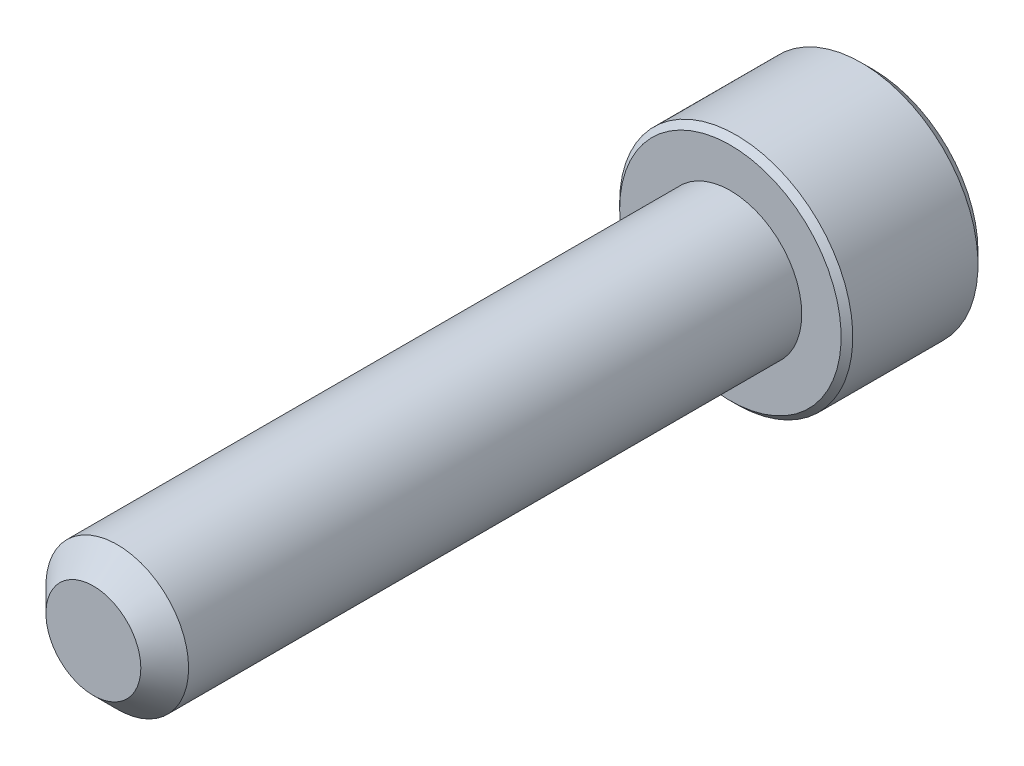
ISO-10303-21;
HEADER;
FILE_DESCRIPTION(('STEP AP214'),'2;1');
FILE_NAME('part.step','',(''),(''),'','','');
FILE_SCHEMA(('AUTOMOTIVE_DESIGN { 1 0 10303 214 1 1 1 1 }'));
ENDSEC;
DATA;
#1=APPLICATION_CONTEXT('core data for automotive mechanical design processes');
#2=APPLICATION_PROTOCOL_DEFINITION('international standard','automotive_design',2000,#1);
#3=PRODUCT_CONTEXT('',#1,'mechanical');
#4=PRODUCT('Part','Part','',(#3));
#5=PRODUCT_RELATED_PRODUCT_CATEGORY('part','',(#4));
#6=PRODUCT_DEFINITION_FORMATION('','',#4);
#7=PRODUCT_DEFINITION_CONTEXT('part definition',#1,'design');
#8=PRODUCT_DEFINITION('design','',#6,#7);
#9=PRODUCT_DEFINITION_SHAPE('','',#8);
#10=(LENGTH_UNIT() NAMED_UNIT(*) SI_UNIT(.MILLI.,.METRE.));
#11=(NAMED_UNIT(*) PLANE_ANGLE_UNIT() SI_UNIT($,.RADIAN.));
#12=(NAMED_UNIT(*) SI_UNIT($,.STERADIAN.) SOLID_ANGLE_UNIT());
#13=UNCERTAINTY_MEASURE_WITH_UNIT(LENGTH_MEASURE(1.E-05),#10,'distance_accuracy_value','');
#14=(GEOMETRIC_REPRESENTATION_CONTEXT(3) GLOBAL_UNCERTAINTY_ASSIGNED_CONTEXT((#13)) GLOBAL_UNIT_ASSIGNED_CONTEXT((#10,
#11,#12)) REPRESENTATION_CONTEXT('',''));
#15=CARTESIAN_POINT('',(0.,0.,0.));
#16=DIRECTION('',(0.,0.,1.));
#17=DIRECTION('',(1.,0.,0.));
#18=AXIS2_PLACEMENT_3D('',#15,#16,#17);
#19=CARTESIAN_POINT('',(0.,0.,-12.7));
#20=DIRECTION('',(0.,0.,1.));
#21=DIRECTION('',(1.,0.,0.));
#22=AXIS2_PLACEMENT_3D('',#19,#20,#21);
#23=CYLINDRICAL_SURFACE('',#22,1.4224);
#24=CARTESIAN_POINT('',(0.,0.,-0.476249999999999));
#25=DIRECTION('',(0.,0.,1.));
#26=DIRECTION('',(1.,0.,0.));
#27=AXIS2_PLACEMENT_3D('',#24,#25,#26);
#28=CIRCLE('',#27,1.4224);
#29=CARTESIAN_POINT('',(1.4224,0.,-0.476249999999999));
#30=VERTEX_POINT('',#29);
#31=EDGE_CURVE('E109',#30,#30,#28,.F.);
#32=ORIENTED_EDGE('',*,*,#31,.T.);
#33=EDGE_LOOP('',(#32));
#34=FACE_BOUND('',#33,.T.);
#35=CARTESIAN_POINT('',(0.,0.,-12.7));
#36=DIRECTION('',(0.,0.,-1.));
#37=DIRECTION('',(-1.,0.,0.));
#38=AXIS2_PLACEMENT_3D('',#35,#36,#37);
#39=CIRCLE('',#38,1.4224);
#40=CARTESIAN_POINT('',(-1.4224,0.,-12.7));
#41=VERTEX_POINT('',#40);
#42=EDGE_CURVE('E209',#41,#41,#39,.F.);
#43=ORIENTED_EDGE('',*,*,#42,.T.);
#44=EDGE_LOOP('',(#43));
#45=FACE_BOUND('',#44,.T.);
#46=ADVANCED_FACE('F35',(#34,#45),#23,.T.);
#47=CARTESIAN_POINT('',(0.,0.,0.));
#48=DIRECTION('',(0.,0.,1.));
#49=DIRECTION('',(1.,0.,0.));
#50=AXIS2_PLACEMENT_3D('',#47,#48,#49);
#51=PLANE('',#50);
#52=CARTESIAN_POINT('',(0.,0.,0.));
#53=DIRECTION('',(0.,0.,1.));
#54=DIRECTION('',(1.,0.,0.));
#55=AXIS2_PLACEMENT_3D('',#52,#53,#54);
#56=CIRCLE('',#55,0.946150000000003);
#57=CARTESIAN_POINT('',(0.946150000000003,0.,0.));
#58=VERTEX_POINT('',#57);
#59=EDGE_CURVE('E208',#58,#58,#56,.T.);
#60=ORIENTED_EDGE('',*,*,#59,.T.);
#61=EDGE_LOOP('',(#60));
#62=FACE_BOUND('',#61,.T.);
#63=ADVANCED_FACE('F186',(#62),#51,.T.);
#64=CARTESIAN_POINT('',(0.,0.,0.));
#65=DIRECTION('',(0.,0.,-1.));
#66=DIRECTION('',(-1.,0.,0.));
#67=AXIS2_PLACEMENT_3D('',#64,#65,#66);
#68=CONICAL_SURFACE('',#67,0.946150000000003,0.785398163397446);
#69=ORIENTED_EDGE('',*,*,#31,.F.);
#70=EDGE_LOOP('',(#69));
#71=FACE_BOUND('',#70,.T.);
#72=ORIENTED_EDGE('',*,*,#59,.F.);
#73=EDGE_LOOP('',(#72));
#74=FACE_BOUND('',#73,.T.);
#75=ADVANCED_FACE('F192',(#71,#74),#68,.T.);
#76=CARTESIAN_POINT('',(0.,0.,-15.5448));
#77=DIRECTION('',(0.,0.,1.));
#78=DIRECTION('',(1.,0.,0.));
#79=AXIS2_PLACEMENT_3D('',#76,#77,#78);
#80=CYLINDRICAL_SURFACE('',#79,2.3241);
#81=CARTESIAN_POINT('',(0.,0.,-12.816205));
#82=DIRECTION('',(0.,0.,-1.));
#83=DIRECTION('',(-1.,0.,0.));
#84=AXIS2_PLACEMENT_3D('',#81,#82,#83);
#85=CIRCLE('',#84,2.3241);
#86=CARTESIAN_POINT('',(-2.3241,0.,-12.816205));
#87=VERTEX_POINT('',#86);
#88=EDGE_CURVE('E43',#87,#87,#85,.T.);
#89=ORIENTED_EDGE('',*,*,#88,.T.);
#90=EDGE_LOOP('',(#89));
#91=FACE_BOUND('',#90,.T.);
#92=CARTESIAN_POINT('',(0.,0.,-15.31239));
#93=DIRECTION('',(0.,0.,-1.));
#94=DIRECTION('',(-1.,0.,0.));
#95=AXIS2_PLACEMENT_3D('',#92,#93,#94);
#96=CIRCLE('',#95,2.3241);
#97=CARTESIAN_POINT('',(-2.3241,0.,-15.31239));
#98=VERTEX_POINT('',#97);
#99=EDGE_CURVE('E169',#98,#98,#96,.F.);
#100=ORIENTED_EDGE('',*,*,#99,.T.);
#101=EDGE_LOOP('',(#100));
#102=FACE_BOUND('',#101,.T.);
#103=ADVANCED_FACE('F174',(#91,#102),#80,.T.);
#104=CARTESIAN_POINT('',(0.,0.,-15.5448));
#105=DIRECTION('',(0.,0.,-1.));
#106=DIRECTION('',(-1.,0.,0.));
#107=AXIS2_PLACEMENT_3D('',#104,#105,#106);
#108=PLANE('',#107);
#109=CARTESIAN_POINT('',(0.,0.,-15.5448));
#110=DIRECTION('',(0.,0.,-1.));
#111=DIRECTION('',(-1.,0.,0.));
#112=AXIS2_PLACEMENT_3D('',#109,#110,#111);
#113=CIRCLE('',#112,2.09169);
#114=CARTESIAN_POINT('',(-2.09169,0.,-15.5448));
#115=VERTEX_POINT('',#114);
#116=EDGE_CURVE('E108',#115,#115,#113,.T.);
#117=ORIENTED_EDGE('',*,*,#116,.T.);
#118=EDGE_LOOP('',(#117));
#119=FACE_BOUND('',#118,.T.);
#120=CARTESIAN_POINT('',(0.,0.,-15.5448));
#121=DIRECTION('',(0.,0.,-1.));
#122=DIRECTION('',(-1.,0.,0.));
#123=AXIS2_PLACEMENT_3D('',#120,#121,#122);
#124=CIRCLE('',#123,1.3748153285078);
#125=CARTESIAN_POINT('',(-1.190625,0.687407664253897,-15.5448));
#126=VERTEX_POINT('',#125);
#127=CARTESIAN_POINT('',(0.,1.3748153285078,-15.5448));
#128=VERTEX_POINT('',#127);
#129=EDGE_CURVE('E89',#126,#128,#124,.T.);
#130=ORIENTED_EDGE('',*,*,#129,.F.);
#131=CARTESIAN_POINT('',(-1.190625,-0.687407664253898,-15.5448));
#132=VERTEX_POINT('',#131);
#133=EDGE_CURVE('E49',#132,#126,#124,.T.);
#134=ORIENTED_EDGE('',*,*,#133,.F.);
#135=CARTESIAN_POINT('',(0.,-1.3748153285078,-15.5448));
#136=VERTEX_POINT('',#135);
#137=EDGE_CURVE('E265',#136,#132,#124,.T.);
#138=ORIENTED_EDGE('',*,*,#137,.F.);
#139=CARTESIAN_POINT('',(1.190625,-0.687407664253898,-15.5448));
#140=VERTEX_POINT('',#139);
#141=EDGE_CURVE('E56',#140,#136,#124,.T.);
#142=ORIENTED_EDGE('',*,*,#141,.F.);
#143=CARTESIAN_POINT('',(1.190625,0.687407664253899,-15.5448));
#144=VERTEX_POINT('',#143);
#145=EDGE_CURVE('E130',#144,#140,#124,.T.);
#146=ORIENTED_EDGE('',*,*,#145,.F.);
#147=EDGE_CURVE('E98',#128,#144,#124,.T.);
#148=ORIENTED_EDGE('',*,*,#147,.F.);
#149=EDGE_LOOP('',(#130,#134,#138,#142,#146,#148));
#150=FACE_BOUND('',#149,.T.);
#151=ADVANCED_FACE('F129',(#119,#150),#108,.T.);
#152=CARTESIAN_POINT('',(0.,0.,-12.7));
#153=DIRECTION('',(0.,0.,-1.));
#154=DIRECTION('',(-1.,0.,0.));
#155=AXIS2_PLACEMENT_3D('',#152,#153,#154);
#156=PLANE('',#155);
#157=CARTESIAN_POINT('',(0.,0.,-12.7));
#158=DIRECTION('',(0.,0.,-1.));
#159=DIRECTION('',(-1.,0.,0.));
#160=AXIS2_PLACEMENT_3D('',#157,#158,#159);
#161=CIRCLE('',#160,2.207895);
#162=CARTESIAN_POINT('',(-2.207895,0.,-12.7));
#163=VERTEX_POINT('',#162);
#164=EDGE_CURVE('E11',#163,#163,#161,.F.);
#165=ORIENTED_EDGE('',*,*,#164,.T.);
#166=EDGE_LOOP('',(#165));
#167=FACE_BOUND('',#166,.T.);
#168=ORIENTED_EDGE('',*,*,#42,.F.);
#169=EDGE_LOOP('',(#168));
#170=FACE_BOUND('',#169,.T.);
#171=ADVANCED_FACE('F277',(#167,#170),#156,.F.);
#172=CARTESIAN_POINT('',(0.,0.,-15.5448));
#173=DIRECTION('',(0.,0.,-1.));
#174=DIRECTION('',(-1.,0.,0.));
#175=AXIS2_PLACEMENT_3D('',#172,#173,#174);
#176=CONICAL_SURFACE('',#175,1.3748153285078,0.78539816339745);
#177=ORIENTED_EDGE('',*,*,#147,.T.);
#178=CARTESIAN_POINT('',(-0.00020000000000008,1.37493079856163,-15.5449154846));
#179=CARTESIAN_POINT('',(0.0407344195898564,1.35129730039231,-15.5212987642143));
#180=CARTESIAN_POINT('',(0.0823533883019738,1.32726857760297,-15.4990687817231));
#181=CARTESIAN_POINT('',(0.167219443673632,1.27827113768909,-15.4583656626274));
#182=CARTESIAN_POINT('',(0.21047460729096,1.25329775733078,-15.4399151826475));
#183=CARTESIAN_POINT('',(0.297696647457423,1.2029400889614,-15.4083088380043));
#184=CARTESIAN_POINT('',(0.341641294957924,1.17756863489755,-15.3950735042433));
#185=CARTESIAN_POINT('',(0.430498374163692,1.12626697629869,-15.3746814515754));
#186=CARTESIAN_POINT('',(0.475408088834753,1.10033834044413,-15.367509502896));
#187=CARTESIAN_POINT('',(0.552804127656977,1.05565371659591,-15.3610385386489));
#188=CARTESIAN_POINT('',(0.585190412515645,1.0369554863147,-15.3600803201468));
#189=CARTESIAN_POINT('',(0.649906073317768,0.999591882129811,-15.3616926490721));
#190=CARTESIAN_POINT('',(0.682235435127271,0.980926516386365,-15.3642639751796));
#191=CARTESIAN_POINT('',(0.746582156071483,0.943775919727755,-15.3727867539936));
#192=CARTESIAN_POINT('',(0.778599196336766,0.925290872911938,-15.3787413547526));
#193=CARTESIAN_POINT('',(0.842098763396455,0.888629380776602,-15.3937099640712));
#194=CARTESIAN_POINT('',(0.873581054644162,0.870453071450032,-15.4027252859121));
#195=CARTESIAN_POINT('',(0.954214838572125,0.823899134593445,-15.429482295838));
#196=CARTESIAN_POINT('',(1.00285783526766,0.795815087357089,-15.449236814436));
#197=CARTESIAN_POINT('',(1.09823941635212,0.740746505842243,-15.4937367689577));
#198=CARTESIAN_POINT('',(1.14498361758716,0.713758728676141,-15.5184659647162));
#199=CARTESIAN_POINT('',(1.190825,0.68729219420006,-15.5449154846));
#200=B_SPLINE_CURVE_WITH_KNOTS('',3,(#178,#179,#180,#181,#182,#183,#184,#185,#186,#187,#188,
#189,#190,#191,#192,#193,#194,#195,#196,#197,#198,#199),.UNSPECIFIED.,.F.,.F.,(4,2,2,2,2,2,2,2,
2,2,4),(0.,0.158625672934121,0.31817607984327,0.475191357500654,0.631811068630747,
0.743878551794716,0.855970763007027,0.96816744442324,1.08041232768376,1.25873351645467,
1.43648174479847),.UNSPECIFIED.);
#201=EDGE_CURVE('E103',#128,#144,#200,.T.);
#202=ORIENTED_EDGE('',*,*,#201,.F.);
#203=EDGE_LOOP('',(#177,#202));
#204=FACE_BOUND('',#203,.T.);
#205=ADVANCED_FACE('F104',(#204),#176,.F.);
#206=ORIENTED_EDGE('',*,*,#145,.T.);
#207=CARTESIAN_POINT('',(1.190625,-1.37097145294694,-15.9857904472899));
#208=CARTESIAN_POINT('',(1.190625,-1.3375892063789,-15.9605899888078));
#209=CARTESIAN_POINT('',(1.190625,-1.30402095496658,-15.9356366202375));
#210=CARTESIAN_POINT('',(1.190625,-1.23643692297761,-15.8863260871772));
#211=CARTESIAN_POINT('',(1.190625,-1.20242103219112,-15.8619690738994));
#212=CARTESIAN_POINT('',(1.190625,-1.09909081482554,-15.7895982089892));
#213=CARTESIAN_POINT('',(1.190625,-1.02900143506767,-15.7426726225956));
#214=CARTESIAN_POINT('',(1.190625,-0.882026737424228,-15.6505521033256));
#215=CARTESIAN_POINT('',(1.190625,-0.80498186601998,-15.6056088372421));
#216=CARTESIAN_POINT('',(1.190625,-0.647043893307964,-15.5233980245069));
#217=CARTESIAN_POINT('',(1.190625,-0.56616494370292,-15.4861046017321));
#218=CARTESIAN_POINT('',(1.190625,-0.444764933868856,-15.4404795555631));
#219=CARTESIAN_POINT('',(1.190625,-0.406041211486714,-15.4273848390215));
#220=CARTESIAN_POINT('',(1.190625,-0.327658904711933,-15.4043042758966));
#221=CARTESIAN_POINT('',(1.190625,-0.288000256118252,-15.394318643486));
#222=CARTESIAN_POINT('',(1.190625,-0.208647693212097,-15.3781412290653));
#223=CARTESIAN_POINT('',(1.190625,-0.168967240621962,-15.371884445849));
#224=CARTESIAN_POINT('',(1.190625,-0.089181974296534,-15.3632868884185));
#225=CARTESIAN_POINT('',(1.190625,-0.0490772347013132,-15.3609454410499));
#226=CARTESIAN_POINT('',(1.190625,0.0297075773931756,-15.3603522440677));
#227=CARTESIAN_POINT('',(1.190625,0.0683866068288078,-15.3619553537961));
#228=CARTESIAN_POINT('',(1.190625,0.14541687663315,-15.3688430277445));
#229=CARTESIAN_POINT('',(1.190625,0.183768052740678,-15.3741282976685));
#230=CARTESIAN_POINT('',(1.190625,0.260508634904943,-15.3881814122329));
#231=CARTESIAN_POINT('',(1.190625,0.298887052039132,-15.3970083626058));
#232=CARTESIAN_POINT('',(1.190625,0.374805334250663,-15.4176757099806));
#233=CARTESIAN_POINT('',(1.190625,0.412345269207093,-15.4295158548359));
#234=CARTESIAN_POINT('',(1.190625,0.530535580908839,-15.4712473336672));
#235=CARTESIAN_POINT('',(1.190625,0.609503725744447,-15.5058913969143));
#236=CARTESIAN_POINT('',(1.190625,0.763730269113466,-15.5829182519749));
#237=CARTESIAN_POINT('',(1.190625,0.838974064674606,-15.6253288466687));
#238=CARTESIAN_POINT('',(1.190625,0.982775796189618,-15.712825645025));
#239=CARTESIAN_POINT('',(1.190625,1.05148016607044,-15.7576741620552));
#240=CARTESIAN_POINT('',(1.190625,1.15270222256253,-15.8270053299226));
#241=CARTESIAN_POINT('',(1.190625,1.18600604145834,-15.8503601763372));
#242=CARTESIAN_POINT('',(1.190625,1.25215860362231,-15.8976875690193));
#243=CARTESIAN_POINT('',(1.190625,1.28500746868278,-15.9216599448583));
#244=CARTESIAN_POINT('',(1.190625,1.31766689427973,-15.9458883667713));
#245=B_SPLINE_CURVE_WITH_KNOTS('',3,(#207,#208,#209,#210,#211,#212,#213,#214,#215,#216,#217,
#218,#219,#220,#221,#222,#223,#224,#225,#226,#227,#228,#229,#230,#231,#232,#233,#234,#235,#236,
#237,#238,#239,#240,#241,#242,#243,#244),.UNSPECIFIED.,.F.,.F.,(4,2,2,2,2,2,2,2,2,2,2,2,2,2,2,2,
2,2,4),(0.,0.125475644763331,0.25098278241397,0.503912518769175,0.771279184643225,
1.03772598255657,1.16025581644629,1.28279408906665,1.40312855503246,1.5234423300503,
1.63939577664877,1.75537145240477,1.87336894094838,1.99135655861152,2.24929724983449,
2.50818004711563,2.75419821472196,2.87622362118596,2.99821570388961),.UNSPECIFIED.);
#246=EDGE_CURVE('E97',#144,#140,#245,.F.);
#247=ORIENTED_EDGE('',*,*,#246,.F.);
#248=EDGE_LOOP('',(#206,#247));
#249=FACE_BOUND('',#248,.T.);
#250=ADVANCED_FACE('F271',(#249),#176,.F.);
#251=ORIENTED_EDGE('',*,*,#141,.T.);
#252=CARTESIAN_POINT('',(1.190825,-0.687292194200061,-15.5449154846));
#253=CARTESIAN_POINT('',(1.14989058041014,-0.710925692369385,-15.5212987642143));
#254=CARTESIAN_POINT('',(1.10827161169803,-0.734954415158721,-15.4990687817231));
#255=CARTESIAN_POINT('',(1.02340555632637,-0.783951855072609,-15.4583656626274));
#256=CARTESIAN_POINT('',(0.98015039270904,-0.808925235430915,-15.4399151826476));
#257=CARTESIAN_POINT('',(0.892928352542576,-0.859282903800292,-15.4083088380043));
#258=CARTESIAN_POINT('',(0.848983705042076,-0.884654357864149,-15.3950735042433));
#259=CARTESIAN_POINT('',(0.760126625836307,-0.935956016463003,-15.3746814515754));
#260=CARTESIAN_POINT('',(0.715216911165246,-0.961884652317569,-15.367509502896));
#261=CARTESIAN_POINT('',(0.637820872343022,-1.00656927616579,-15.3610385386489));
#262=CARTESIAN_POINT('',(0.605434587484354,-1.025267506447,-15.3600803201468));
#263=CARTESIAN_POINT('',(0.540718926682231,-1.06263111063189,-15.3616926490721));
#264=CARTESIAN_POINT('',(0.508389564872728,-1.08129647637533,-15.3642639751796));
#265=CARTESIAN_POINT('',(0.444042843928516,-1.11844707303394,-15.3727867539936));
#266=CARTESIAN_POINT('',(0.412025803663233,-1.13693211984976,-15.3787413547526));
#267=CARTESIAN_POINT('',(0.348526236603543,-1.17359361198509,-15.3937099640712));
#268=CARTESIAN_POINT('',(0.317043945355836,-1.19176992131166,-15.4027252859121));
#269=CARTESIAN_POINT('',(0.236410161427874,-1.23832385816825,-15.429482295838));
#270=CARTESIAN_POINT('',(0.187767164732343,-1.26640790540461,-15.449236814436));
#271=CARTESIAN_POINT('',(0.0923855836478815,-1.32147648691945,-15.4937367689577));
#272=CARTESIAN_POINT('',(0.0456413824128449,-1.34846426408555,-15.5184659647162));
#273=CARTESIAN_POINT('',(-0.000199999999999968,-1.37493079856163,-15.5449154846));
#274=B_SPLINE_CURVE_WITH_KNOTS('',3,(#252,#253,#254,#255,#256,#257,#258,#259,#260,#261,#262,
#263,#264,#265,#266,#267,#268,#269,#270,#271,#272,#273),.UNSPECIFIED.,.F.,.F.,(4,2,2,2,2,2,2,2,
2,2,4),(0.,0.158625672934119,0.31817607984327,0.475191357500655,0.631811068630748,
0.743878551794717,0.855970763007028,0.968167444423241,1.08041232768376,1.25873351645467,
1.43648174479847),.UNSPECIFIED.);
#275=EDGE_CURVE('E139',#140,#136,#274,.T.);
#276=ORIENTED_EDGE('',*,*,#275,.F.);
#277=EDGE_LOOP('',(#251,#276));
#278=FACE_BOUND('',#277,.T.);
#279=ADVANCED_FACE('F268',(#278),#176,.F.);
#280=ORIENTED_EDGE('',*,*,#137,.T.);
#281=CARTESIAN_POINT('',(0.000200000000000319,-1.37493079856163,-15.5449154846));
#282=CARTESIAN_POINT('',(-0.0407344195898563,-1.35129730039231,-15.5212987642143));
#283=CARTESIAN_POINT('',(-0.0823533883019738,-1.32726857760297,-15.4990687817231));
#284=CARTESIAN_POINT('',(-0.167219443673632,-1.27827113768909,-15.4583656626274));
#285=CARTESIAN_POINT('',(-0.21047460729096,-1.25329775733078,-15.4399151826475));
#286=CARTESIAN_POINT('',(-0.297696647457424,-1.2029400889614,-15.4083088380043));
#287=CARTESIAN_POINT('',(-0.341641294957925,-1.17756863489755,-15.3950735042433));
#288=CARTESIAN_POINT('',(-0.430498374163694,-1.12626697629869,-15.3746814515754));
#289=CARTESIAN_POINT('',(-0.475408088834755,-1.10033834044413,-15.367509502896));
#290=CARTESIAN_POINT('',(-0.552804127656978,-1.0556537165959,-15.3610385386489));
#291=CARTESIAN_POINT('',(-0.585190412515647,-1.0369554863147,-15.3600803201468));
#292=CARTESIAN_POINT('',(-0.64990607331777,-0.99959188212981,-15.3616926490721));
#293=CARTESIAN_POINT('',(-0.682235435127273,-0.980926516386364,-15.3642639751796));
#294=CARTESIAN_POINT('',(-0.746582156071485,-0.943775919727754,-15.3727867539936));
#295=CARTESIAN_POINT('',(-0.778599196336768,-0.925290872911937,-15.3787413547526));
#296=CARTESIAN_POINT('',(-0.842098763396458,-0.888629380776601,-15.3937099640712));
#297=CARTESIAN_POINT('',(-0.873581054644165,-0.870453071450031,-15.4027252859121));
#298=CARTESIAN_POINT('',(-0.954214838572127,-0.823899134593444,-15.429482295838));
#299=CARTESIAN_POINT('',(-1.00285783526766,-0.795815087357089,-15.449236814436));
#300=CARTESIAN_POINT('',(-1.09823941635212,-0.740746505842244,-15.4937367689577));
#301=CARTESIAN_POINT('',(-1.14498361758716,-0.713758728676141,-15.5184659647162));
#302=CARTESIAN_POINT('',(-1.190825,-0.68729219420006,-15.5449154846));
#303=B_SPLINE_CURVE_WITH_KNOTS('',3,(#281,#282,#283,#284,#285,#286,#287,#288,#289,#290,#291,
#292,#293,#294,#295,#296,#297,#298,#299,#300,#301,#302),.UNSPECIFIED.,.F.,.F.,(4,2,2,2,2,2,2,2,
2,2,4),(0.,0.158625672934121,0.318176079843271,0.475191357500656,0.631811068630749,
0.743878551794719,0.85597076300703,0.968167444423243,1.08041232768377,1.25873351645467,
1.43648174479847),.UNSPECIFIED.);
#304=EDGE_CURVE('E243',#136,#132,#303,.T.);
#305=ORIENTED_EDGE('',*,*,#304,.F.);
#306=EDGE_LOOP('',(#280,#305));
#307=FACE_BOUND('',#306,.T.);
#308=ADVANCED_FACE('F267',(#307),#176,.F.);
#309=ORIENTED_EDGE('',*,*,#133,.T.);
#310=CARTESIAN_POINT('',(-1.190625,-1.37097145294693,-15.9857904472899));
#311=CARTESIAN_POINT('',(-1.190625,-1.3375892063789,-15.9605899888078));
#312=CARTESIAN_POINT('',(-1.190625,-1.30402095496658,-15.9356366202375));
#313=CARTESIAN_POINT('',(-1.190625,-1.23643692297761,-15.8863260871772));
#314=CARTESIAN_POINT('',(-1.190625,-1.20242103219112,-15.8619690738994));
#315=CARTESIAN_POINT('',(-1.190625,-1.09909081482554,-15.7895982089892));
#316=CARTESIAN_POINT('',(-1.190625,-1.02900143506767,-15.7426726225956));
#317=CARTESIAN_POINT('',(-1.190625,-0.882026737424228,-15.6505521033256));
#318=CARTESIAN_POINT('',(-1.190625,-0.804981866019979,-15.6056088372421));
#319=CARTESIAN_POINT('',(-1.190625,-0.647043893307963,-15.5233980245069));
#320=CARTESIAN_POINT('',(-1.190625,-0.56616494370292,-15.4861046017321));
#321=CARTESIAN_POINT('',(-1.190625,-0.444764933868855,-15.4404795555631));
#322=CARTESIAN_POINT('',(-1.190625,-0.406041211486712,-15.4273848390215));
#323=CARTESIAN_POINT('',(-1.190625,-0.327658904711932,-15.4043042758966));
#324=CARTESIAN_POINT('',(-1.190625,-0.288000256118251,-15.394318643486));
#325=CARTESIAN_POINT('',(-1.190625,-0.208647693212096,-15.3781412290653));
#326=CARTESIAN_POINT('',(-1.190625,-0.168967240621961,-15.371884445849));
#327=CARTESIAN_POINT('',(-1.190625,-0.0891819742965325,-15.3632868884185));
#328=CARTESIAN_POINT('',(-1.190625,-0.0490772347013116,-15.3609454410499));
#329=CARTESIAN_POINT('',(-1.190625,0.0297075773931773,-15.3603522440677));
#330=CARTESIAN_POINT('',(-1.190625,0.0683866068288096,-15.3619553537961));
#331=CARTESIAN_POINT('',(-1.190625,0.145416876633151,-15.3688430277445));
#332=CARTESIAN_POINT('',(-1.190625,0.18376805274068,-15.3741282976685));
#333=CARTESIAN_POINT('',(-1.190625,0.260508634904945,-15.3881814122329));
#334=CARTESIAN_POINT('',(-1.190625,0.298887052039133,-15.3970083626058));
#335=CARTESIAN_POINT('',(-1.190625,0.374805334250664,-15.4176757099806));
#336=CARTESIAN_POINT('',(-1.190625,0.412345269207094,-15.4295158548359));
#337=CARTESIAN_POINT('',(-1.190625,0.53053558090884,-15.4712473336672));
#338=CARTESIAN_POINT('',(-1.190625,0.609503725744448,-15.5058913969143));
#339=CARTESIAN_POINT('',(-1.190625,0.763730269113467,-15.5829182519749));
#340=CARTESIAN_POINT('',(-1.190625,0.838974064674606,-15.6253288466687));
#341=CARTESIAN_POINT('',(-1.190625,0.982775796189619,-15.712825645025));
#342=CARTESIAN_POINT('',(-1.190625,1.05148016607044,-15.7576741620552));
#343=CARTESIAN_POINT('',(-1.190625,1.15270222256254,-15.8270053299226));
#344=CARTESIAN_POINT('',(-1.190625,1.18600604145834,-15.8503601763372));
#345=CARTESIAN_POINT('',(-1.190625,1.25215860362232,-15.8976875690193));
#346=CARTESIAN_POINT('',(-1.190625,1.28500746868279,-15.9216599448583));
#347=CARTESIAN_POINT('',(-1.190625,1.31766689427973,-15.9458883667713));
#348=B_SPLINE_CURVE_WITH_KNOTS('',3,(#310,#311,#312,#313,#314,#315,#316,#317,#318,#319,#320,
#321,#322,#323,#324,#325,#326,#327,#328,#329,#330,#331,#332,#333,#334,#335,#336,#337,#338,#339,
#340,#341,#342,#343,#344,#345,#346,#347),.UNSPECIFIED.,.F.,.F.,(4,2,2,2,2,2,2,2,2,2,2,2,2,2,2,2,
2,2,4),(0.,0.12547564476333,0.250982782413967,0.503912518769175,0.771279184643225,
1.03772598255657,1.16025581644629,1.28279408906665,1.40312855503246,1.5234423300503,
1.63939577664877,1.75537145240478,1.87336894094838,1.99135655861152,2.24929724983449,
2.50818004711563,2.75419821472196,2.87622362118597,2.99821570388961),.UNSPECIFIED.);
#349=EDGE_CURVE('E119',#132,#126,#348,.T.);
#350=ORIENTED_EDGE('',*,*,#349,.F.);
#351=EDGE_LOOP('',(#309,#350));
#352=FACE_BOUND('',#351,.T.);
#353=ADVANCED_FACE('F284',(#352),#176,.F.);
#354=ORIENTED_EDGE('',*,*,#129,.T.);
#355=CARTESIAN_POINT('',(-1.190825,0.68729219420006,-15.5449154846));
#356=CARTESIAN_POINT('',(-1.14989058041014,0.710925692369385,-15.5212987642143));
#357=CARTESIAN_POINT('',(-1.10827161169803,0.73495441515872,-15.4990687817231));
#358=CARTESIAN_POINT('',(-1.02340555632637,0.783951855072609,-15.4583656626274));
#359=CARTESIAN_POINT('',(-0.98015039270904,0.808925235430915,-15.4399151826476));
#360=CARTESIAN_POINT('',(-0.892928352542576,0.859282903800292,-15.4083088380043));
#361=CARTESIAN_POINT('',(-0.848983705042074,0.884654357864149,-15.3950735042433));
#362=CARTESIAN_POINT('',(-0.760126625836306,0.935956016463004,-15.3746814515754));
#363=CARTESIAN_POINT('',(-0.715216911165244,0.96188465231757,-15.367509502896));
#364=CARTESIAN_POINT('',(-0.637820872343021,1.00656927616579,-15.3610385386489));
#365=CARTESIAN_POINT('',(-0.605434587484352,1.025267506447,-15.3600803201468));
#366=CARTESIAN_POINT('',(-0.540718926682229,1.06263111063189,-15.3616926490721));
#367=CARTESIAN_POINT('',(-0.508389564872727,1.08129647637533,-15.3642639751796));
#368=CARTESIAN_POINT('',(-0.444042843928514,1.11844707303394,-15.3727867539936));
#369=CARTESIAN_POINT('',(-0.412025803663231,1.13693211984976,-15.3787413547526));
#370=CARTESIAN_POINT('',(-0.348526236603542,1.17359361198509,-15.3937099640712));
#371=CARTESIAN_POINT('',(-0.317043945355835,1.19176992131166,-15.4027252859121));
#372=CARTESIAN_POINT('',(-0.236410161427872,1.23832385816825,-15.429482295838));
#373=CARTESIAN_POINT('',(-0.187767164732341,1.26640790540461,-15.449236814436));
#374=CARTESIAN_POINT('',(-0.0923855836478804,1.32147648691945,-15.4937367689577));
#375=CARTESIAN_POINT('',(-0.0456413824128438,1.34846426408555,-15.5184659647162));
#376=CARTESIAN_POINT('',(0.00020000000000077,1.37493079856163,-15.5449154846));
#377=B_SPLINE_CURVE_WITH_KNOTS('',3,(#355,#356,#357,#358,#359,#360,#361,#362,#363,#364,#365,
#366,#367,#368,#369,#370,#371,#372,#373,#374,#375,#376),.UNSPECIFIED.,.F.,.F.,(4,2,2,2,2,2,2,2,
2,2,4),(0.,0.15862567293412,0.318176079843272,0.475191357500657,0.631811068630751,
0.74387855179472,0.855970763007031,0.968167444423244,1.08041232768377,1.25873351645467,
1.43648174479847),.UNSPECIFIED.);
#378=EDGE_CURVE('E93',#126,#128,#377,.T.);
#379=ORIENTED_EDGE('',*,*,#378,.F.);
#380=EDGE_LOOP('',(#354,#379));
#381=FACE_BOUND('',#380,.T.);
#382=ADVANCED_FACE('F91',(#381),#176,.F.);
#383=CARTESIAN_POINT('',(1.190625,2.06222299276169,-13.7588625));
#384=DIRECTION('',(0.,0.,-1.));
#385=DIRECTION('',(-1.,0.,0.));
#386=AXIS2_PLACEMENT_3D('',#383,#384,#385);
#387=PLANE('',#386);
#388=DIRECTION('',(0.866025403784439,0.5,0.));
#389=VECTOR('',#388,1.);
#390=CARTESIAN_POINT('',(-1.190625,0.687407664253898,-13.7588625));
#391=LINE('',#390,#389);
#392=CARTESIAN_POINT('',(-1.190625,0.687407664253898,-13.7588625));
#393=VERTEX_POINT('',#392);
#394=CARTESIAN_POINT('',(0.,1.3748153285078,-13.7588625));
#395=VERTEX_POINT('',#394);
#396=EDGE_CURVE('E118',#393,#395,#391,.T.);
#397=ORIENTED_EDGE('',*,*,#396,.T.);
#398=DIRECTION('',(0.866025403784439,-0.5,0.));
#399=VECTOR('',#398,1.);
#400=CARTESIAN_POINT('',(0.,1.3748153285078,-13.7588625));
#401=LINE('',#400,#399);
#402=CARTESIAN_POINT('',(1.190625,0.687407664253898,-13.7588625));
#403=VERTEX_POINT('',#402);
#404=EDGE_CURVE('E123',#395,#403,#401,.T.);
#405=ORIENTED_EDGE('',*,*,#404,.T.);
#406=DIRECTION('',(0.,-1.,0.));
#407=VECTOR('',#406,1.);
#408=CARTESIAN_POINT('',(1.190625,0.687407664253898,-13.7588625));
#409=LINE('',#408,#407);
#410=CARTESIAN_POINT('',(1.190625,-0.687407664253899,-13.7588625));
#411=VERTEX_POINT('',#410);
#412=EDGE_CURVE('E231',#403,#411,#409,.T.);
#413=ORIENTED_EDGE('',*,*,#412,.T.);
#414=DIRECTION('',(-0.866025403784439,-0.5,0.));
#415=VECTOR('',#414,1.);
#416=CARTESIAN_POINT('',(1.190625,-0.687407664253899,-13.7588625));
#417=LINE('',#416,#415);
#418=CARTESIAN_POINT('',(0.,-1.3748153285078,-13.7588625));
#419=VERTEX_POINT('',#418);
#420=EDGE_CURVE('E228',#411,#419,#417,.T.);
#421=ORIENTED_EDGE('',*,*,#420,.T.);
#422=DIRECTION('',(-0.866025403784439,0.5,0.));
#423=VECTOR('',#422,1.);
#424=CARTESIAN_POINT('',(0.,-1.3748153285078,-13.7588625));
#425=LINE('',#424,#423);
#426=CARTESIAN_POINT('',(-1.190625,-0.687407664253898,-13.7588625));
#427=VERTEX_POINT('',#426);
#428=EDGE_CURVE('E225',#419,#427,#425,.T.);
#429=ORIENTED_EDGE('',*,*,#428,.T.);
#430=DIRECTION('',(0.,1.,0.));
#431=VECTOR('',#430,1.);
#432=CARTESIAN_POINT('',(-1.190625,-0.687407664253898,-13.7588625));
#433=LINE('',#432,#431);
#434=EDGE_CURVE('E126',#427,#393,#433,.T.);
#435=ORIENTED_EDGE('',*,*,#434,.T.);
#436=EDGE_LOOP('',(#397,#405,#413,#421,#429,#435));
#437=FACE_BOUND('',#436,.T.);
#438=ADVANCED_FACE('F158',(#437),#387,.T.);
#439=CARTESIAN_POINT('',(0.,1.3748153285078,-13.7588625));
#440=DIRECTION('',(0.5,0.866025403784439,0.));
#441=DIRECTION('',(-0.866025403784439,0.5,0.));
#442=AXIS2_PLACEMENT_3D('',#439,#440,#441);
#443=PLANE('',#442);
#444=DIRECTION('',(0.,0.,-1.));
#445=VECTOR('',#444,1.);
#446=CARTESIAN_POINT('',(0.,1.3748153285078,-13.7588625));
#447=LINE('',#446,#445);
#448=EDGE_CURVE('E115',#395,#128,#447,.T.);
#449=ORIENTED_EDGE('',*,*,#448,.T.);
#450=ORIENTED_EDGE('',*,*,#201,.T.);
#451=DIRECTION('',(0.,0.,-1.));
#452=VECTOR('',#451,1.);
#453=CARTESIAN_POINT('',(1.190625,0.687407664253898,-13.7588625));
#454=LINE('',#453,#452);
#455=EDGE_CURVE('E125',#403,#144,#454,.T.);
#456=ORIENTED_EDGE('',*,*,#455,.F.);
#457=ORIENTED_EDGE('',*,*,#404,.F.);
#458=EDGE_LOOP('',(#449,#450,#456,#457));
#459=FACE_BOUND('',#458,.T.);
#460=ADVANCED_FACE('F121',(#459),#443,.F.);
#461=CARTESIAN_POINT('',(1.190625,0.687407664253898,-13.7588625));
#462=DIRECTION('',(1.,0.,0.));
#463=DIRECTION('',(0.,0.,-1.));
#464=AXIS2_PLACEMENT_3D('',#461,#462,#463);
#465=PLANE('',#464);
#466=ORIENTED_EDGE('',*,*,#455,.T.);
#467=ORIENTED_EDGE('',*,*,#246,.T.);
#468=DIRECTION('',(0.,0.,-1.));
#469=VECTOR('',#468,1.);
#470=CARTESIAN_POINT('',(1.190625,-0.687407664253899,-13.7588625));
#471=LINE('',#470,#469);
#472=EDGE_CURVE('E214',#411,#140,#471,.T.);
#473=ORIENTED_EDGE('',*,*,#472,.F.);
#474=ORIENTED_EDGE('',*,*,#412,.F.);
#475=EDGE_LOOP('',(#466,#467,#473,#474));
#476=FACE_BOUND('',#475,.T.);
#477=ADVANCED_FACE('F147',(#476),#465,.F.);
#478=CARTESIAN_POINT('',(1.190625,-0.687407664253899,-13.7588625));
#479=DIRECTION('',(0.5,-0.866025403784439,0.));
#480=DIRECTION('',(0.866025403784439,0.5,0.));
#481=AXIS2_PLACEMENT_3D('',#478,#479,#480);
#482=PLANE('',#481);
#483=ORIENTED_EDGE('',*,*,#472,.T.);
#484=ORIENTED_EDGE('',*,*,#275,.T.);
#485=DIRECTION('',(0.,0.,-1.));
#486=VECTOR('',#485,1.);
#487=CARTESIAN_POINT('',(0.,-1.3748153285078,-13.7588625));
#488=LINE('',#487,#486);
#489=EDGE_CURVE('E217',#419,#136,#488,.T.);
#490=ORIENTED_EDGE('',*,*,#489,.F.);
#491=ORIENTED_EDGE('',*,*,#420,.F.);
#492=EDGE_LOOP('',(#483,#484,#490,#491));
#493=FACE_BOUND('',#492,.T.);
#494=ADVANCED_FACE('F151',(#493),#482,.F.);
#495=CARTESIAN_POINT('',(0.,-1.3748153285078,-13.7588625));
#496=DIRECTION('',(-0.5,-0.866025403784439,0.));
#497=DIRECTION('',(0.866025403784439,-0.5,0.));
#498=AXIS2_PLACEMENT_3D('',#495,#496,#497);
#499=PLANE('',#498);
#500=ORIENTED_EDGE('',*,*,#489,.T.);
#501=ORIENTED_EDGE('',*,*,#304,.T.);
#502=DIRECTION('',(0.,0.,-1.));
#503=VECTOR('',#502,1.);
#504=CARTESIAN_POINT('',(-1.190625,-0.687407664253898,-13.7588625));
#505=LINE('',#504,#503);
#506=EDGE_CURVE('E220',#427,#132,#505,.T.);
#507=ORIENTED_EDGE('',*,*,#506,.F.);
#508=ORIENTED_EDGE('',*,*,#428,.F.);
#509=EDGE_LOOP('',(#500,#501,#507,#508));
#510=FACE_BOUND('',#509,.T.);
#511=ADVANCED_FACE('F250',(#510),#499,.F.);
#512=CARTESIAN_POINT('',(-1.190625,-0.687407664253898,-13.7588625));
#513=DIRECTION('',(-1.,0.,0.));
#514=DIRECTION('',(0.,0.,1.));
#515=AXIS2_PLACEMENT_3D('',#512,#513,#514);
#516=PLANE('',#515);
#517=ORIENTED_EDGE('',*,*,#506,.T.);
#518=ORIENTED_EDGE('',*,*,#349,.T.);
#519=DIRECTION('',(0.,0.,-1.));
#520=VECTOR('',#519,1.);
#521=CARTESIAN_POINT('',(-1.190625,0.687407664253898,-13.7588625));
#522=LINE('',#521,#520);
#523=EDGE_CURVE('E117',#393,#126,#522,.T.);
#524=ORIENTED_EDGE('',*,*,#523,.F.);
#525=ORIENTED_EDGE('',*,*,#434,.F.);
#526=EDGE_LOOP('',(#517,#518,#524,#525));
#527=FACE_BOUND('',#526,.T.);
#528=ADVANCED_FACE('F247',(#527),#516,.F.);
#529=CARTESIAN_POINT('',(-1.190625,0.687407664253898,-13.7588625));
#530=DIRECTION('',(-0.5,0.866025403784439,0.));
#531=DIRECTION('',(-0.866025403784439,-0.5,0.));
#532=AXIS2_PLACEMENT_3D('',#529,#530,#531);
#533=PLANE('',#532);
#534=ORIENTED_EDGE('',*,*,#523,.T.);
#535=ORIENTED_EDGE('',*,*,#378,.T.);
#536=ORIENTED_EDGE('',*,*,#448,.F.);
#537=ORIENTED_EDGE('',*,*,#396,.F.);
#538=EDGE_LOOP('',(#534,#535,#536,#537));
#539=FACE_BOUND('',#538,.T.);
#540=ADVANCED_FACE('F113',(#539),#533,.F.);
#541=CARTESIAN_POINT('',(0.,0.,-15.5448));
#542=DIRECTION('',(0.,0.,1.));
#543=DIRECTION('',(1.,0.,0.));
#544=AXIS2_PLACEMENT_3D('',#541,#542,#543);
#545=CONICAL_SURFACE('',#544,2.09169,0.785398163397451);
#546=ORIENTED_EDGE('',*,*,#99,.F.);
#547=EDGE_LOOP('',(#546));
#548=FACE_BOUND('',#547,.T.);
#549=ORIENTED_EDGE('',*,*,#116,.F.);
#550=EDGE_LOOP('',(#549));
#551=FACE_BOUND('',#550,.T.);
#552=ADVANCED_FACE('F178',(#548,#551),#545,.T.);
#553=CARTESIAN_POINT('',(0.,0.,-12.816205));
#554=DIRECTION('',(0.,0.,-1.));
#555=DIRECTION('',(-1.,0.,0.));
#556=AXIS2_PLACEMENT_3D('',#553,#554,#555);
#557=CONICAL_SURFACE('',#556,2.3241,0.785398163397454);
#558=ORIENTED_EDGE('',*,*,#164,.F.);
#559=EDGE_LOOP('',(#558));
#560=FACE_BOUND('',#559,.T.);
#561=ORIENTED_EDGE('',*,*,#88,.F.);
#562=EDGE_LOOP('',(#561));
#563=FACE_BOUND('',#562,.T.);
#564=ADVANCED_FACE('F37',(#560,#563),#557,.T.);
#565=CLOSED_SHELL('',(#46,#63,#75,#103,#151,#171,#205,#250,#279,#308,#353,#382,#438,#460,#477,
#494,#511,#528,#540,#552,#564));
#566=MANIFOLD_SOLID_BREP('B2',#565);
#567=ADVANCED_BREP_SHAPE_REPRESENTATION('',(#18,#566),#14);
#568=SHAPE_DEFINITION_REPRESENTATION(#9,#567);
ENDSEC;
END-ISO-10303-21;
